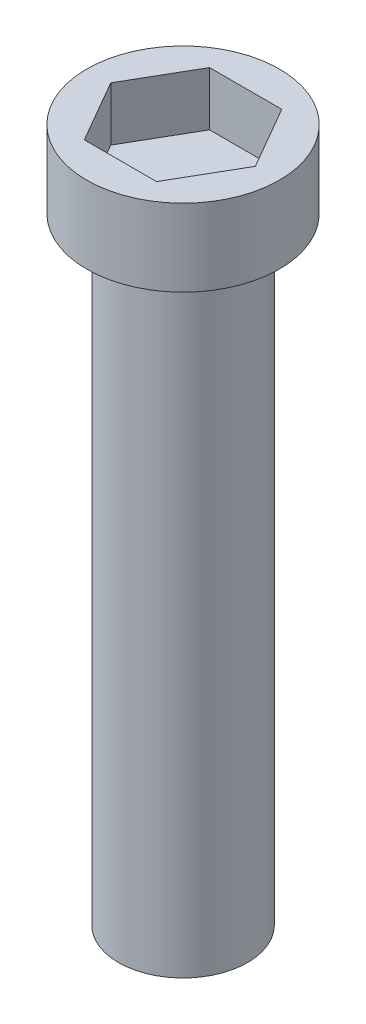
ISO-10303-21;
HEADER;
FILE_DESCRIPTION(('STEP AP214'),'2;1');
FILE_NAME('part.step','',(''),(''),'','','');
FILE_SCHEMA(('AUTOMOTIVE_DESIGN { 1 0 10303 214 1 1 1 1 }'));
ENDSEC;
DATA;
#1=APPLICATION_CONTEXT('core data for automotive mechanical design processes');
#2=APPLICATION_PROTOCOL_DEFINITION('international standard','automotive_design',2000,#1);
#3=PRODUCT_CONTEXT('',#1,'mechanical');
#4=PRODUCT('Part','Part','',(#3));
#5=PRODUCT_RELATED_PRODUCT_CATEGORY('part','',(#4));
#6=PRODUCT_DEFINITION_FORMATION('','',#4);
#7=PRODUCT_DEFINITION_CONTEXT('part definition',#1,'design');
#8=PRODUCT_DEFINITION('design','',#6,#7);
#9=PRODUCT_DEFINITION_SHAPE('','',#8);
#10=(LENGTH_UNIT() NAMED_UNIT(*) SI_UNIT(.MILLI.,.METRE.));
#11=(NAMED_UNIT(*) PLANE_ANGLE_UNIT() SI_UNIT($,.RADIAN.));
#12=(NAMED_UNIT(*) SI_UNIT($,.STERADIAN.) SOLID_ANGLE_UNIT());
#13=UNCERTAINTY_MEASURE_WITH_UNIT(LENGTH_MEASURE(1.E-05),#10,'distance_accuracy_value','');
#14=(GEOMETRIC_REPRESENTATION_CONTEXT(3) GLOBAL_UNCERTAINTY_ASSIGNED_CONTEXT((#13)) GLOBAL_UNIT_ASSIGNED_CONTEXT((#10,
#11,#12)) REPRESENTATION_CONTEXT('',''));
#15=CARTESIAN_POINT('',(0.,0.,0.));
#16=DIRECTION('',(0.,0.,1.));
#17=DIRECTION('',(1.,0.,0.));
#18=AXIS2_PLACEMENT_3D('',#15,#16,#17);
#19=CARTESIAN_POINT('',(0.,4.,0.));
#20=DIRECTION('',(0.,1.,0.));
#21=DIRECTION('',(0.,0.,1.));
#22=AXIS2_PLACEMENT_3D('',#19,#20,#21);
#23=PLANE('',#22);
#24=CARTESIAN_POINT('',(0.,4.,0.));
#25=DIRECTION('',(0.,1.,0.));
#26=DIRECTION('',(0.,0.,1.));
#27=AXIS2_PLACEMENT_3D('',#24,#25,#26);
#28=CIRCLE('',#27,5.);
#29=CARTESIAN_POINT('',(0.,4.,5.));
#30=VERTEX_POINT('',#29);
#31=EDGE_CURVE('E11',#30,#30,#28,.T.);
#32=ORIENTED_EDGE('',*,*,#31,.T.);
#33=EDGE_LOOP('',(#32));
#34=FACE_BOUND('',#33,.T.);
#35=DIRECTION('',(-0.5,0.,-0.866025403784439));
#36=VECTOR('',#35,1.);
#37=CARTESIAN_POINT('',(3.75277674973257,4.,0.));
#38=LINE('',#37,#36);
#39=CARTESIAN_POINT('',(3.75277674973257,4.,0.));
#40=VERTEX_POINT('',#39);
#41=CARTESIAN_POINT('',(1.87638837486628,4.,-3.25));
#42=VERTEX_POINT('',#41);
#43=EDGE_CURVE('E123',#40,#42,#38,.T.);
#44=ORIENTED_EDGE('',*,*,#43,.F.);
#45=DIRECTION('',(0.5,0.,-0.866025403784439));
#46=VECTOR('',#45,1.);
#47=CARTESIAN_POINT('',(1.87638837486628,4.,3.25));
#48=LINE('',#47,#46);
#49=CARTESIAN_POINT('',(1.87638837486628,4.,3.25));
#50=VERTEX_POINT('',#49);
#51=EDGE_CURVE('E95',#50,#40,#48,.T.);
#52=ORIENTED_EDGE('',*,*,#51,.F.);
#53=DIRECTION('',(1.,0.,0.));
#54=VECTOR('',#53,1.);
#55=CARTESIAN_POINT('',(-1.87638837486628,4.,3.25));
#56=LINE('',#55,#54);
#57=CARTESIAN_POINT('',(-1.87638837486628,4.,3.25));
#58=VERTEX_POINT('',#57);
#59=EDGE_CURVE('E56',#58,#50,#56,.T.);
#60=ORIENTED_EDGE('',*,*,#59,.F.);
#61=DIRECTION('',(0.5,0.,0.866025403784439));
#62=VECTOR('',#61,1.);
#63=CARTESIAN_POINT('',(-3.75277674973257,4.,0.));
#64=LINE('',#63,#62);
#65=CARTESIAN_POINT('',(-3.75277674973257,4.,0.));
#66=VERTEX_POINT('',#65);
#67=EDGE_CURVE('E129',#66,#58,#64,.T.);
#68=ORIENTED_EDGE('',*,*,#67,.F.);
#69=DIRECTION('',(-0.5,0.,0.866025403784439));
#70=VECTOR('',#69,1.);
#71=CARTESIAN_POINT('',(-1.87638837486628,4.,-3.25));
#72=LINE('',#71,#70);
#73=CARTESIAN_POINT('',(-1.87638837486628,4.,-3.25));
#74=VERTEX_POINT('',#73);
#75=EDGE_CURVE('E127',#74,#66,#72,.T.);
#76=ORIENTED_EDGE('',*,*,#75,.F.);
#77=DIRECTION('',(-1.,0.,0.));
#78=VECTOR('',#77,1.);
#79=CARTESIAN_POINT('',(1.87638837486628,4.,-3.25));
#80=LINE('',#79,#78);
#81=EDGE_CURVE('E125',#42,#74,#80,.T.);
#82=ORIENTED_EDGE('',*,*,#81,.F.);
#83=EDGE_LOOP('',(#44,#52,#60,#68,#76,#82));
#84=FACE_BOUND('',#83,.T.);
#85=ADVANCED_FACE('F36',(#34,#84),#23,.T.);
#86=CARTESIAN_POINT('',(0.,4.,0.));
#87=DIRECTION('',(0.,-1.,0.));
#88=DIRECTION('',(0.,0.,-1.));
#89=AXIS2_PLACEMENT_3D('',#86,#87,#88);
#90=CYLINDRICAL_SURFACE('',#89,5.);
#91=ORIENTED_EDGE('',*,*,#31,.F.);
#92=EDGE_LOOP('',(#91));
#93=FACE_BOUND('',#92,.T.);
#94=CARTESIAN_POINT('',(0.,0.,0.));
#95=DIRECTION('',(0.,1.,0.));
#96=DIRECTION('',(0.,0.,1.));
#97=AXIS2_PLACEMENT_3D('',#94,#95,#96);
#98=CIRCLE('',#97,5.);
#99=CARTESIAN_POINT('',(0.,0.,5.));
#100=VERTEX_POINT('',#99);
#101=EDGE_CURVE('E40',#100,#100,#98,.T.);
#102=ORIENTED_EDGE('',*,*,#101,.T.);
#103=EDGE_LOOP('',(#102));
#104=FACE_BOUND('',#103,.T.);
#105=ADVANCED_FACE('F38',(#93,#104),#90,.T.);
#106=CARTESIAN_POINT('',(0.,0.,0.));
#107=DIRECTION('',(0.,1.,0.));
#108=DIRECTION('',(0.,0.,1.));
#109=AXIS2_PLACEMENT_3D('',#106,#107,#108);
#110=PLANE('',#109);
#111=CARTESIAN_POINT('',(0.,0.,0.));
#112=DIRECTION('',(0.,1.,0.));
#113=DIRECTION('',(0.,0.,1.));
#114=AXIS2_PLACEMENT_3D('',#111,#112,#113);
#115=CIRCLE('',#114,3.35);
#116=CARTESIAN_POINT('',(0.,0.,3.35));
#117=VERTEX_POINT('',#116);
#118=EDGE_CURVE('E98',#117,#117,#115,.T.);
#119=ORIENTED_EDGE('',*,*,#118,.T.);
#120=EDGE_LOOP('',(#119));
#121=FACE_BOUND('',#120,.T.);
#122=ORIENTED_EDGE('',*,*,#101,.F.);
#123=EDGE_LOOP('',(#122));
#124=FACE_BOUND('',#123,.T.);
#125=ADVANCED_FACE('F146',(#121,#124),#110,.F.);
#126=CARTESIAN_POINT('',(0.,-32.,0.));
#127=DIRECTION('',(0.,1.,0.));
#128=DIRECTION('',(0.,0.,1.));
#129=AXIS2_PLACEMENT_3D('',#126,#127,#128);
#130=CYLINDRICAL_SURFACE('',#129,3.35);
#131=CARTESIAN_POINT('',(0.,-32.,0.));
#132=DIRECTION('',(0.,1.,0.));
#133=DIRECTION('',(0.,0.,1.));
#134=AXIS2_PLACEMENT_3D('',#131,#132,#133);
#135=CIRCLE('',#134,3.35);
#136=CARTESIAN_POINT('',(0.,-32.,3.35));
#137=VERTEX_POINT('',#136);
#138=EDGE_CURVE('E140',#137,#137,#135,.T.);
#139=ORIENTED_EDGE('',*,*,#138,.T.);
#140=EDGE_LOOP('',(#139));
#141=FACE_BOUND('',#140,.T.);
#142=ORIENTED_EDGE('',*,*,#118,.F.);
#143=EDGE_LOOP('',(#142));
#144=FACE_BOUND('',#143,.T.);
#145=ADVANCED_FACE('F149',(#141,#144),#130,.T.);
#146=CARTESIAN_POINT('',(0.,-32.,0.));
#147=DIRECTION('',(0.,1.,0.));
#148=DIRECTION('',(0.,0.,1.));
#149=AXIS2_PLACEMENT_3D('',#146,#147,#148);
#150=PLANE('',#149);
#151=ORIENTED_EDGE('',*,*,#138,.F.);
#152=EDGE_LOOP('',(#151));
#153=FACE_BOUND('',#152,.T.);
#154=ADVANCED_FACE('F151',(#153),#150,.F.);
#155=CARTESIAN_POINT('',(1.87638837486628,4.,3.25));
#156=DIRECTION('',(-0.866025403784439,0.,-0.5));
#157=DIRECTION('',(-0.5,0.,0.866025403784439));
#158=AXIS2_PLACEMENT_3D('',#155,#156,#157);
#159=PLANE('',#158);
#160=DIRECTION('',(0.,-1.,0.));
#161=VECTOR('',#160,1.);
#162=CARTESIAN_POINT('',(1.87638837486628,4.,3.25));
#163=LINE('',#162,#161);
#164=CARTESIAN_POINT('',(1.87638837486628,1.2,3.25));
#165=VERTEX_POINT('',#164);
#166=EDGE_CURVE('E132',#50,#165,#163,.T.);
#167=ORIENTED_EDGE('',*,*,#166,.F.);
#168=ORIENTED_EDGE('',*,*,#51,.T.);
#169=DIRECTION('',(0.,-1.,0.));
#170=VECTOR('',#169,1.);
#171=CARTESIAN_POINT('',(3.75277674973257,4.,0.));
#172=LINE('',#171,#170);
#173=CARTESIAN_POINT('',(3.75277674973257,1.2,0.));
#174=VERTEX_POINT('',#173);
#175=EDGE_CURVE('E88',#40,#174,#172,.T.);
#176=ORIENTED_EDGE('',*,*,#175,.T.);
#177=DIRECTION('',(0.5,0.,-0.866025403784439));
#178=VECTOR('',#177,1.);
#179=CARTESIAN_POINT('',(1.87638837486628,1.2,3.25));
#180=LINE('',#179,#178);
#181=EDGE_CURVE('E92',#165,#174,#180,.T.);
#182=ORIENTED_EDGE('',*,*,#181,.F.);
#183=EDGE_LOOP('',(#167,#168,#176,#182));
#184=FACE_BOUND('',#183,.T.);
#185=ADVANCED_FACE('F90',(#184),#159,.T.);
#186=CARTESIAN_POINT('',(3.75277674973257,4.,0.));
#187=DIRECTION('',(-0.866025403784439,0.,0.5));
#188=DIRECTION('',(0.5,0.,0.866025403784439));
#189=AXIS2_PLACEMENT_3D('',#186,#187,#188);
#190=PLANE('',#189);
#191=ORIENTED_EDGE('',*,*,#175,.F.);
#192=ORIENTED_EDGE('',*,*,#43,.T.);
#193=DIRECTION('',(0.,-1.,0.));
#194=VECTOR('',#193,1.);
#195=CARTESIAN_POINT('',(1.87638837486628,4.,-3.25));
#196=LINE('',#195,#194);
#197=CARTESIAN_POINT('',(1.87638837486628,1.2,-3.25));
#198=VERTEX_POINT('',#197);
#199=EDGE_CURVE('E99',#42,#198,#196,.T.);
#200=ORIENTED_EDGE('',*,*,#199,.T.);
#201=DIRECTION('',(-0.5,0.,-0.866025403784439));
#202=VECTOR('',#201,1.);
#203=CARTESIAN_POINT('',(3.75277674973257,1.2,0.));
#204=LINE('',#203,#202);
#205=EDGE_CURVE('E102',#174,#198,#204,.T.);
#206=ORIENTED_EDGE('',*,*,#205,.F.);
#207=EDGE_LOOP('',(#191,#192,#200,#206));
#208=FACE_BOUND('',#207,.T.);
#209=ADVANCED_FACE('F103',(#208),#190,.T.);
#210=CARTESIAN_POINT('',(1.87638837486628,4.,-3.25));
#211=DIRECTION('',(0.,0.,1.));
#212=DIRECTION('',(1.,0.,0.));
#213=AXIS2_PLACEMENT_3D('',#210,#211,#212);
#214=PLANE('',#213);
#215=ORIENTED_EDGE('',*,*,#199,.F.);
#216=ORIENTED_EDGE('',*,*,#81,.T.);
#217=DIRECTION('',(0.,-1.,0.));
#218=VECTOR('',#217,1.);
#219=CARTESIAN_POINT('',(-1.87638837486628,4.,-3.25));
#220=LINE('',#219,#218);
#221=CARTESIAN_POINT('',(-1.87638837486628,1.2,-3.25));
#222=VERTEX_POINT('',#221);
#223=EDGE_CURVE('E137',#74,#222,#220,.T.);
#224=ORIENTED_EDGE('',*,*,#223,.T.);
#225=DIRECTION('',(-1.,0.,0.));
#226=VECTOR('',#225,1.);
#227=CARTESIAN_POINT('',(1.87638837486628,1.2,-3.25));
#228=LINE('',#227,#226);
#229=EDGE_CURVE('E108',#198,#222,#228,.T.);
#230=ORIENTED_EDGE('',*,*,#229,.F.);
#231=EDGE_LOOP('',(#215,#216,#224,#230));
#232=FACE_BOUND('',#231,.T.);
#233=ADVANCED_FACE('F172',(#232),#214,.T.);
#234=CARTESIAN_POINT('',(-1.87638837486628,4.,-3.25));
#235=DIRECTION('',(0.866025403784439,0.,0.5));
#236=DIRECTION('',(0.5,0.,-0.866025403784439));
#237=AXIS2_PLACEMENT_3D('',#234,#235,#236);
#238=PLANE('',#237);
#239=ORIENTED_EDGE('',*,*,#223,.F.);
#240=ORIENTED_EDGE('',*,*,#75,.T.);
#241=DIRECTION('',(0.,-1.,0.));
#242=VECTOR('',#241,1.);
#243=CARTESIAN_POINT('',(-3.75277674973257,4.,0.));
#244=LINE('',#243,#242);
#245=CARTESIAN_POINT('',(-3.75277674973257,1.2,0.));
#246=VERTEX_POINT('',#245);
#247=EDGE_CURVE('E135',#66,#246,#244,.T.);
#248=ORIENTED_EDGE('',*,*,#247,.T.);
#249=DIRECTION('',(-0.5,0.,0.866025403784439));
#250=VECTOR('',#249,1.);
#251=CARTESIAN_POINT('',(-1.87638837486628,1.2,-3.25));
#252=LINE('',#251,#250);
#253=EDGE_CURVE('E116',#222,#246,#252,.T.);
#254=ORIENTED_EDGE('',*,*,#253,.F.);
#255=EDGE_LOOP('',(#239,#240,#248,#254));
#256=FACE_BOUND('',#255,.T.);
#257=ADVANCED_FACE('F177',(#256),#238,.T.);
#258=CARTESIAN_POINT('',(-3.75277674973257,4.,0.));
#259=DIRECTION('',(0.866025403784439,0.,-0.5));
#260=DIRECTION('',(-0.5,0.,-0.866025403784439));
#261=AXIS2_PLACEMENT_3D('',#258,#259,#260);
#262=PLANE('',#261);
#263=ORIENTED_EDGE('',*,*,#247,.F.);
#264=ORIENTED_EDGE('',*,*,#67,.T.);
#265=DIRECTION('',(0.,-1.,0.));
#266=VECTOR('',#265,1.);
#267=CARTESIAN_POINT('',(-1.87638837486628,4.,3.25));
#268=LINE('',#267,#266);
#269=CARTESIAN_POINT('',(-1.87638837486628,1.2,3.25));
#270=VERTEX_POINT('',#269);
#271=EDGE_CURVE('E51',#58,#270,#268,.T.);
#272=ORIENTED_EDGE('',*,*,#271,.T.);
#273=DIRECTION('',(0.5,0.,0.866025403784439));
#274=VECTOR('',#273,1.);
#275=CARTESIAN_POINT('',(-3.75277674973257,1.2,0.));
#276=LINE('',#275,#274);
#277=EDGE_CURVE('E119',#246,#270,#276,.T.);
#278=ORIENTED_EDGE('',*,*,#277,.F.);
#279=EDGE_LOOP('',(#263,#264,#272,#278));
#280=FACE_BOUND('',#279,.T.);
#281=ADVANCED_FACE('F181',(#280),#262,.T.);
#282=CARTESIAN_POINT('',(-1.87638837486628,4.,3.25));
#283=DIRECTION('',(0.,0.,-1.));
#284=DIRECTION('',(-1.,0.,0.));
#285=AXIS2_PLACEMENT_3D('',#282,#283,#284);
#286=PLANE('',#285);
#287=ORIENTED_EDGE('',*,*,#271,.F.);
#288=ORIENTED_EDGE('',*,*,#59,.T.);
#289=ORIENTED_EDGE('',*,*,#166,.T.);
#290=DIRECTION('',(1.,0.,0.));
#291=VECTOR('',#290,1.);
#292=CARTESIAN_POINT('',(-1.87638837486628,1.2,3.25));
#293=LINE('',#292,#291);
#294=EDGE_CURVE('E112',#270,#165,#293,.T.);
#295=ORIENTED_EDGE('',*,*,#294,.F.);
#296=EDGE_LOOP('',(#287,#288,#289,#295));
#297=FACE_BOUND('',#296,.T.);
#298=ADVANCED_FACE('F183',(#297),#286,.T.);
#299=CARTESIAN_POINT('',(0.,1.2,0.));
#300=DIRECTION('',(0.,1.,0.));
#301=DIRECTION('',(0.,0.,1.));
#302=AXIS2_PLACEMENT_3D('',#299,#300,#301);
#303=PLANE('',#302);
#304=ORIENTED_EDGE('',*,*,#181,.T.);
#305=ORIENTED_EDGE('',*,*,#205,.T.);
#306=ORIENTED_EDGE('',*,*,#229,.T.);
#307=ORIENTED_EDGE('',*,*,#253,.T.);
#308=ORIENTED_EDGE('',*,*,#277,.T.);
#309=ORIENTED_EDGE('',*,*,#294,.T.);
#310=EDGE_LOOP('',(#304,#305,#306,#307,#308,#309));
#311=FACE_BOUND('',#310,.T.);
#312=ADVANCED_FACE('F110',(#311),#303,.T.);
#313=CLOSED_SHELL('',(#85,#105,#125,#145,#154,#185,#209,#233,#257,#281,#298,#312));
#314=MANIFOLD_SOLID_BREP('B2',#313);
#315=ADVANCED_BREP_SHAPE_REPRESENTATION('',(#18,#314),#14);
#316=SHAPE_DEFINITION_REPRESENTATION(#9,#315);
ENDSEC;
END-ISO-10303-21;
